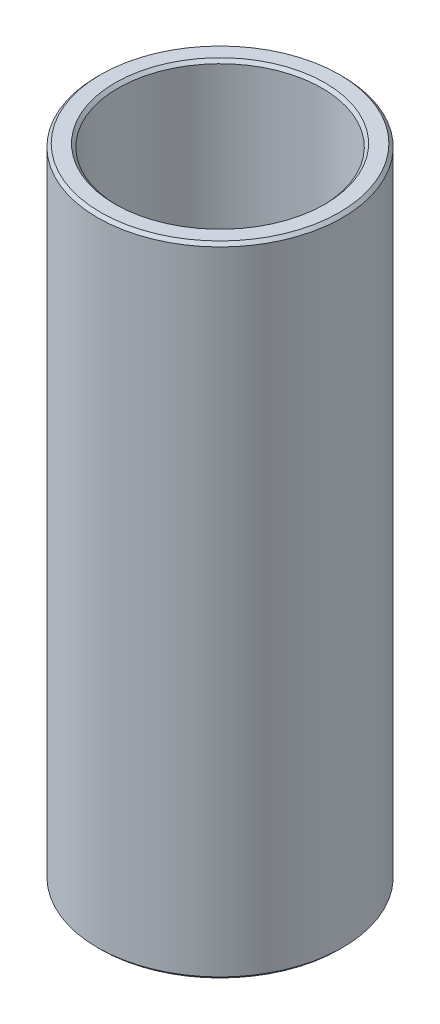
ISO-10303-21;
HEADER;
FILE_DESCRIPTION(('STEP AP214'),'2;1');
FILE_NAME('part.step','',(''),(''),'','','');
FILE_SCHEMA(('AUTOMOTIVE_DESIGN { 1 0 10303 214 1 1 1 1 }'));
ENDSEC;
DATA;
#1=APPLICATION_CONTEXT('core data for automotive mechanical design processes');
#2=APPLICATION_PROTOCOL_DEFINITION('international standard','automotive_design',2000,#1);
#3=PRODUCT_CONTEXT('',#1,'mechanical');
#4=PRODUCT('Part','Part','',(#3));
#5=PRODUCT_RELATED_PRODUCT_CATEGORY('part','',(#4));
#6=PRODUCT_DEFINITION_FORMATION('','',#4);
#7=PRODUCT_DEFINITION_CONTEXT('part definition',#1,'design');
#8=PRODUCT_DEFINITION('design','',#6,#7);
#9=PRODUCT_DEFINITION_SHAPE('','',#8);
#10=(LENGTH_UNIT() NAMED_UNIT(*) SI_UNIT(.MILLI.,.METRE.));
#11=(NAMED_UNIT(*) PLANE_ANGLE_UNIT() SI_UNIT($,.RADIAN.));
#12=(NAMED_UNIT(*) SI_UNIT($,.STERADIAN.) SOLID_ANGLE_UNIT());
#13=UNCERTAINTY_MEASURE_WITH_UNIT(LENGTH_MEASURE(1.E-05),#10,'distance_accuracy_value','');
#14=(GEOMETRIC_REPRESENTATION_CONTEXT(3) GLOBAL_UNCERTAINTY_ASSIGNED_CONTEXT((#13)) GLOBAL_UNIT_ASSIGNED_CONTEXT((#10,
#11,#12)) REPRESENTATION_CONTEXT('',''));
#15=CARTESIAN_POINT('',(0.,0.,0.));
#16=DIRECTION('',(0.,0.,1.));
#17=DIRECTION('',(1.,0.,0.));
#18=AXIS2_PLACEMENT_3D('',#15,#16,#17);
#19=CARTESIAN_POINT('',(0.,208.504632292846,0.));
#20=DIRECTION('',(0.,-1.,0.));
#21=DIRECTION('',(0.,0.,-1.));
#22=AXIS2_PLACEMENT_3D('',#19,#20,#21);
#23=CYLINDRICAL_SURFACE('',#22,40.);
#24=CARTESIAN_POINT('',(0.,0.992620525103682,0.));
#25=DIRECTION('',(0.,1.,0.));
#26=DIRECTION('',(0.,0.,1.));
#27=AXIS2_PLACEMENT_3D('',#24,#25,#26);
#28=CIRCLE('',#27,40.);
#29=CARTESIAN_POINT('',(0.,0.992620525103682,40.));
#30=VERTEX_POINT('',#29);
#31=EDGE_CURVE('E10',#30,#30,#28,.T.);
#32=ORIENTED_EDGE('',*,*,#31,.T.);
#33=EDGE_LOOP('',(#32));
#34=FACE_BOUND('',#33,.T.);
#35=CARTESIAN_POINT('',(0.,207.512011767742,0.));
#36=DIRECTION('',(0.,1.,0.));
#37=DIRECTION('',(0.,0.,1.));
#38=AXIS2_PLACEMENT_3D('',#35,#36,#37);
#39=CIRCLE('',#38,40.);
#40=CARTESIAN_POINT('',(0.,207.512011767742,40.));
#41=VERTEX_POINT('',#40);
#42=EDGE_CURVE('E50',#41,#41,#39,.F.);
#43=ORIENTED_EDGE('',*,*,#42,.T.);
#44=EDGE_LOOP('',(#43));
#45=FACE_BOUND('',#44,.T.);
#46=ADVANCED_FACE('F39',(#34,#45),#23,.T.);
#47=CARTESIAN_POINT('',(0.,208.504632292846,0.));
#48=DIRECTION('',(0.,1.,0.));
#49=DIRECTION('',(0.,0.,1.));
#50=AXIS2_PLACEMENT_3D('',#47,#48,#49);
#51=PLANE('',#50);
#52=CARTESIAN_POINT('',(0.,208.504632292846,0.));
#53=DIRECTION('',(0.,1.,0.));
#54=DIRECTION('',(0.,0.,1.));
#55=AXIS2_PLACEMENT_3D('',#52,#53,#54);
#56=CIRCLE('',#55,34.3240557901112);
#57=CARTESIAN_POINT('',(0.,208.504632292846,34.3240557901112));
#58=VERTEX_POINT('',#57);
#59=EDGE_CURVE('E58',#58,#58,#56,.F.);
#60=ORIENTED_EDGE('',*,*,#59,.T.);
#61=EDGE_LOOP('',(#60));
#62=FACE_BOUND('',#61,.T.);
#63=CARTESIAN_POINT('',(0.,208.504632292846,0.));
#64=DIRECTION('',(0.,1.,0.));
#65=DIRECTION('',(0.,0.,1.));
#66=AXIS2_PLACEMENT_3D('',#63,#64,#65);
#67=CIRCLE('',#66,39.0073794748963);
#68=CARTESIAN_POINT('',(0.,208.504632292846,39.0073794748963));
#69=VERTEX_POINT('',#68);
#70=EDGE_CURVE('E61',#69,#69,#67,.T.);
#71=ORIENTED_EDGE('',*,*,#70,.T.);
#72=EDGE_LOOP('',(#71));
#73=FACE_BOUND('',#72,.T.);
#74=ADVANCED_FACE('F88',(#62,#73),#51,.T.);
#75=CARTESIAN_POINT('',(0.,0.,0.));
#76=DIRECTION('',(0.,1.,0.));
#77=DIRECTION('',(0.,0.,1.));
#78=AXIS2_PLACEMENT_3D('',#75,#76,#77);
#79=PLANE('',#78);
#80=CARTESIAN_POINT('',(0.,0.,0.));
#81=DIRECTION('',(0.,1.,0.));
#82=DIRECTION('',(0.,0.,1.));
#83=AXIS2_PLACEMENT_3D('',#80,#81,#82);
#84=CIRCLE('',#83,34.3240557901112);
#85=CARTESIAN_POINT('',(0.,0.,34.3240557901112));
#86=VERTEX_POINT('',#85);
#87=EDGE_CURVE('E51',#86,#86,#84,.T.);
#88=ORIENTED_EDGE('',*,*,#87,.T.);
#89=EDGE_LOOP('',(#88));
#90=FACE_BOUND('',#89,.T.);
#91=CARTESIAN_POINT('',(0.,0.,0.));
#92=DIRECTION('',(0.,1.,0.));
#93=DIRECTION('',(0.,0.,1.));
#94=AXIS2_PLACEMENT_3D('',#91,#92,#93);
#95=CIRCLE('',#94,39.0073794748963);
#96=CARTESIAN_POINT('',(0.,0.,39.0073794748963));
#97=VERTEX_POINT('',#96);
#98=EDGE_CURVE('E54',#97,#97,#95,.F.);
#99=ORIENTED_EDGE('',*,*,#98,.T.);
#100=EDGE_LOOP('',(#99));
#101=FACE_BOUND('',#100,.T.);
#102=ADVANCED_FACE('F83',(#90,#101),#79,.F.);
#103=CARTESIAN_POINT('',(0.,208.504632292846,0.));
#104=DIRECTION('',(0.,-1.,0.));
#105=DIRECTION('',(0.,0.,-1.));
#106=AXIS2_PLACEMENT_3D('',#103,#104,#105);
#107=CYLINDRICAL_SURFACE('',#106,33.3314352650076);
#108=CARTESIAN_POINT('',(0.,207.512011767742,0.));
#109=DIRECTION('',(0.,1.,0.));
#110=DIRECTION('',(0.,0.,1.));
#111=AXIS2_PLACEMENT_3D('',#108,#109,#110);
#112=CIRCLE('',#111,33.3314352650076);
#113=CARTESIAN_POINT('',(0.,207.512011767742,33.3314352650076));
#114=VERTEX_POINT('',#113);
#115=EDGE_CURVE('E67',#114,#114,#112,.T.);
#116=ORIENTED_EDGE('',*,*,#115,.T.);
#117=EDGE_LOOP('',(#116));
#118=FACE_BOUND('',#117,.T.);
#119=CARTESIAN_POINT('',(0.,0.992620525103655,0.));
#120=DIRECTION('',(0.,1.,0.));
#121=DIRECTION('',(0.,0.,1.));
#122=AXIS2_PLACEMENT_3D('',#119,#120,#121);
#123=CIRCLE('',#122,33.3314352650076);
#124=CARTESIAN_POINT('',(0.,0.992620525103655,33.3314352650076));
#125=VERTEX_POINT('',#124);
#126=EDGE_CURVE('E69',#125,#125,#123,.F.);
#127=ORIENTED_EDGE('',*,*,#126,.T.);
#128=EDGE_LOOP('',(#127));
#129=FACE_BOUND('',#128,.T.);
#130=ADVANCED_FACE('F71',(#118,#129),#107,.F.);
#131=CARTESIAN_POINT('',(0.,207.512011767742,0.));
#132=DIRECTION('',(0.,1.,0.));
#133=DIRECTION('',(0.,0.,1.));
#134=AXIS2_PLACEMENT_3D('',#131,#132,#133);
#135=CONICAL_SURFACE('',#134,33.3314352650076,0.785398163397455);
#136=ORIENTED_EDGE('',*,*,#59,.F.);
#137=EDGE_LOOP('',(#136));
#138=FACE_BOUND('',#137,.T.);
#139=ORIENTED_EDGE('',*,*,#115,.F.);
#140=EDGE_LOOP('',(#139));
#141=FACE_BOUND('',#140,.T.);
#142=ADVANCED_FACE('F77',(#138,#141),#135,.F.);
#143=CARTESIAN_POINT('',(0.,0.,0.));
#144=DIRECTION('',(0.,-1.,0.));
#145=DIRECTION('',(0.,0.,-1.));
#146=AXIS2_PLACEMENT_3D('',#143,#144,#145);
#147=CONICAL_SURFACE('',#146,34.3240557901112,0.785398163397455);
#148=ORIENTED_EDGE('',*,*,#126,.F.);
#149=EDGE_LOOP('',(#148));
#150=FACE_BOUND('',#149,.T.);
#151=ORIENTED_EDGE('',*,*,#87,.F.);
#152=EDGE_LOOP('',(#151));
#153=FACE_BOUND('',#152,.T.);
#154=ADVANCED_FACE('F73',(#150,#153),#147,.F.);
#155=CARTESIAN_POINT('',(0.,0.992620525103682,0.));
#156=DIRECTION('',(0.,1.,0.));
#157=DIRECTION('',(0.,0.,1.));
#158=AXIS2_PLACEMENT_3D('',#155,#156,#157);
#159=CONICAL_SURFACE('',#158,40.,0.785398163397459);
#160=ORIENTED_EDGE('',*,*,#98,.F.);
#161=EDGE_LOOP('',(#160));
#162=FACE_BOUND('',#161,.T.);
#163=ORIENTED_EDGE('',*,*,#31,.F.);
#164=EDGE_LOOP('',(#163));
#165=FACE_BOUND('',#164,.T.);
#166=ADVANCED_FACE('F76',(#162,#165),#159,.T.);
#167=CARTESIAN_POINT('',(0.,208.504632292846,0.));
#168=DIRECTION('',(0.,-1.,0.));
#169=DIRECTION('',(0.,0.,-1.));
#170=AXIS2_PLACEMENT_3D('',#167,#168,#169);
#171=CONICAL_SURFACE('',#170,39.0073794748963,0.785398163397445);
#172=ORIENTED_EDGE('',*,*,#42,.F.);
#173=EDGE_LOOP('',(#172));
#174=FACE_BOUND('',#173,.T.);
#175=ORIENTED_EDGE('',*,*,#70,.F.);
#176=EDGE_LOOP('',(#175));
#177=FACE_BOUND('',#176,.T.);
#178=ADVANCED_FACE('F45',(#174,#177),#171,.T.);
#179=CLOSED_SHELL('',(#46,#74,#102,#130,#142,#154,#166,#178));
#180=MANIFOLD_SOLID_BREP('B2',#179);
#181=ADVANCED_BREP_SHAPE_REPRESENTATION('',(#18,#180),#14);
#182=SHAPE_DEFINITION_REPRESENTATION(#9,#181);
ENDSEC;
END-ISO-10303-21;
